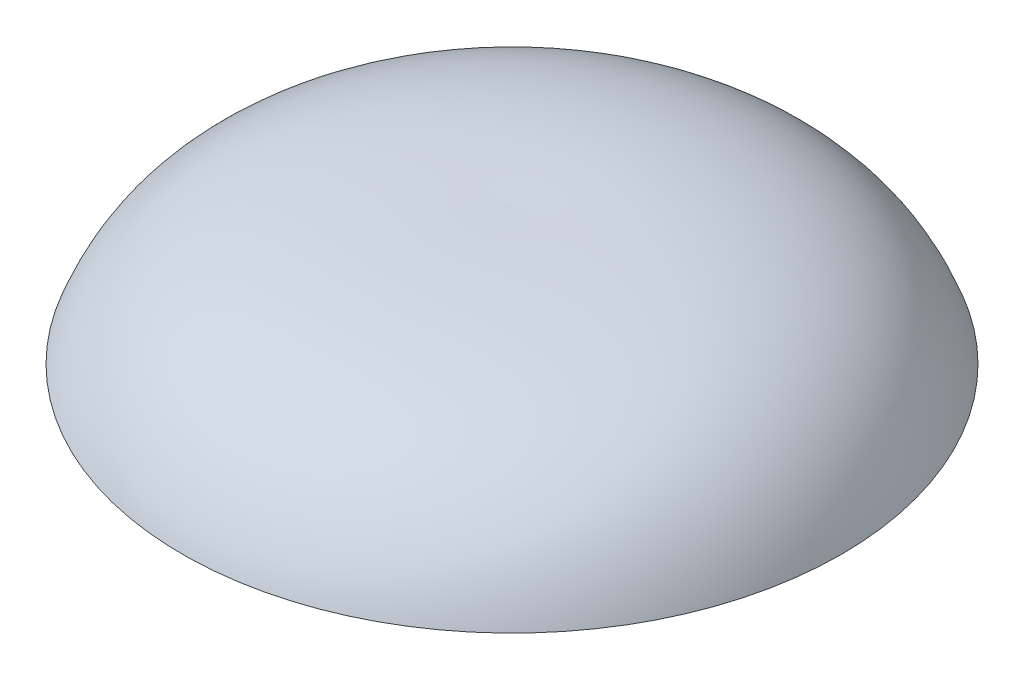
ISO-10303-21;
HEADER;
FILE_DESCRIPTION(('STEP AP214'),'2;1');
FILE_NAME('part.step','',(''),(''),'','','');
FILE_SCHEMA(('AUTOMOTIVE_DESIGN { 1 0 10303 214 1 1 1 1 }'));
ENDSEC;
DATA;
#1=APPLICATION_CONTEXT('core data for automotive mechanical design processes');
#2=APPLICATION_PROTOCOL_DEFINITION('international standard','automotive_design',2000,#1);
#3=PRODUCT_CONTEXT('',#1,'mechanical');
#4=PRODUCT('Part','Part','',(#3));
#5=PRODUCT_RELATED_PRODUCT_CATEGORY('part','',(#4));
#6=PRODUCT_DEFINITION_FORMATION('','',#4);
#7=PRODUCT_DEFINITION_CONTEXT('part definition',#1,'design');
#8=PRODUCT_DEFINITION('design','',#6,#7);
#9=PRODUCT_DEFINITION_SHAPE('','',#8);
#10=(LENGTH_UNIT() NAMED_UNIT(*) SI_UNIT(.MILLI.,.METRE.));
#11=(NAMED_UNIT(*) PLANE_ANGLE_UNIT() SI_UNIT($,.RADIAN.));
#12=(NAMED_UNIT(*) SI_UNIT($,.STERADIAN.) SOLID_ANGLE_UNIT());
#13=UNCERTAINTY_MEASURE_WITH_UNIT(LENGTH_MEASURE(1.E-05),#10,'distance_accuracy_value','');
#14=(GEOMETRIC_REPRESENTATION_CONTEXT(3) GLOBAL_UNCERTAINTY_ASSIGNED_CONTEXT((#13)) GLOBAL_UNIT_ASSIGNED_CONTEXT((#10,
#11,#12)) REPRESENTATION_CONTEXT('',''));
#15=CARTESIAN_POINT('',(0.,0.,0.));
#16=DIRECTION('',(0.,0.,1.));
#17=DIRECTION('',(1.,0.,0.));
#18=AXIS2_PLACEMENT_3D('',#15,#16,#17);
#19=CARTESIAN_POINT('',(-2.54000000000018,6.35000000000002,-4.44089209850063E-13));
#20=DIRECTION('',(0.,-1.,0.));
#21=DIRECTION('',(0.,0.,-1.));
#22=AXIS2_PLACEMENT_3D('',#19,#20,#21);
#23=CYLINDRICAL_SURFACE('',#22,2.54);
#24=CARTESIAN_POINT('',(-2.54000000000018,0.,-4.44089209850063E-13));
#25=DIRECTION('',(0.,-1.,0.));
#26=DIRECTION('',(0.,0.,-1.));
#27=AXIS2_PLACEMENT_3D('',#24,#25,#26);
#28=CIRCLE('',#27,2.54);
#29=CARTESIAN_POINT('',(-2.54000000000018,0.,-2.54000000000044));
#30=VERTEX_POINT('',#29);
#31=EDGE_CURVE('E11',#30,#30,#28,.T.);
#32=ORIENTED_EDGE('',*,*,#31,.T.);
#33=EDGE_LOOP('',(#32));
#34=FACE_BOUND('',#33,.T.);
#35=CARTESIAN_POINT('',(-2.54000000000018,-2.53999999999999,-4.44089209850063E-13));
#36=DIRECTION('',(0.,-1.,0.));
#37=DIRECTION('',(0.,0.,-1.));
#38=AXIS2_PLACEMENT_3D('',#35,#36,#37);
#39=CIRCLE('',#38,2.54);
#40=CARTESIAN_POINT('',(-2.54000000000018,-2.53999999999999,-2.54000000000044));
#41=VERTEX_POINT('',#40);
#42=EDGE_CURVE('E46',#41,#41,#39,.T.);
#43=ORIENTED_EDGE('',*,*,#42,.F.);
#44=EDGE_LOOP('',(#43));
#45=FACE_BOUND('',#44,.T.);
#46=ADVANCED_FACE('F28',(#34,#45),#23,.T.);
#47=CARTESIAN_POINT('',(0.,0.,0.));
#48=DIRECTION('',(0.,-1.,0.));
#49=DIRECTION('',(0.,0.,-1.));
#50=AXIS2_PLACEMENT_3D('',#47,#48,#49);
#51=PLANE('',#50);
#52=CARTESIAN_POINT('',(-2.54000000000018,0.,-4.44089209850063E-13));
#53=DIRECTION('',(0.,-1.,0.));
#54=DIRECTION('',(0.,0.,-1.));
#55=AXIS2_PLACEMENT_3D('',#52,#53,#54);
#56=CIRCLE('',#55,15.24);
#57=CARTESIAN_POINT('',(-2.54000000000018,0.,-15.2400000000004));
#58=VERTEX_POINT('',#57);
#59=EDGE_CURVE('E34',#58,#58,#56,.T.);
#60=ORIENTED_EDGE('',*,*,#59,.T.);
#61=EDGE_LOOP('',(#60));
#62=FACE_BOUND('',#61,.T.);
#63=ORIENTED_EDGE('',*,*,#31,.F.);
#64=EDGE_LOOP('',(#63));
#65=FACE_BOUND('',#64,.T.);
#66=ADVANCED_FACE('F41',(#62,#65),#51,.T.);
#67=CARTESIAN_POINT('',(12.6999999999998,0.,-1.11022302462516E-13));
#68=CARTESIAN_POINT('',(10.8168869312528,5.17735360140609,0.));
#69=CARTESIAN_POINT('',(5.73738068764651,6.64842858458653,-4.44089209850063E-13));
#70=CARTESIAN_POINT('',(-2.54000000000018,6.35000000000002,-4.44089209850063E-13));
#71=B_SPLINE_CURVE_WITH_KNOTS('',3,(#67,#68,#69,#70),.UNSPECIFIED.,.F.,.F.,(4,4),(0.,1.),.UNSPECIFIED.);
#72=CARTESIAN_POINT('',(-2.54000000000018,6.35000000000002,-4.44089209850063E-13));
#73=DIRECTION('',(0.,-1.,0.));
#74=AXIS1_PLACEMENT('',#72,#73);
#75=SURFACE_OF_REVOLUTION('',#71,#74);
#76=CARTESIAN_POINT('',(-2.54000000000018,6.35000000000002,-4.44089209850063E-13));
#77=VERTEX_POINT('',#76);
#78=VERTEX_LOOP('',#77);
#79=FACE_BOUND('',#78,.T.);
#80=ORIENTED_EDGE('',*,*,#59,.F.);
#81=EDGE_LOOP('',(#80));
#82=FACE_BOUND('',#81,.T.);
#83=ADVANCED_FACE('F37',(#79,#82),#75,.F.);
#84=CARTESIAN_POINT('',(0.,-2.53999999999999,0.));
#85=DIRECTION('',(0.,-1.,0.));
#86=DIRECTION('',(0.,0.,-1.));
#87=AXIS2_PLACEMENT_3D('',#84,#85,#86);
#88=PLANE('',#87);
#89=ORIENTED_EDGE('',*,*,#42,.T.);
#90=EDGE_LOOP('',(#89));
#91=FACE_BOUND('',#90,.T.);
#92=ADVANCED_FACE('F40',(#91),#88,.T.);
#93=CLOSED_SHELL('',(#46,#66,#83,#92));
#94=MANIFOLD_SOLID_BREP('B2',#93);
#95=ADVANCED_BREP_SHAPE_REPRESENTATION('',(#18,#94),#14);
#96=SHAPE_DEFINITION_REPRESENTATION(#9,#95);
ENDSEC;
END-ISO-10303-21;
